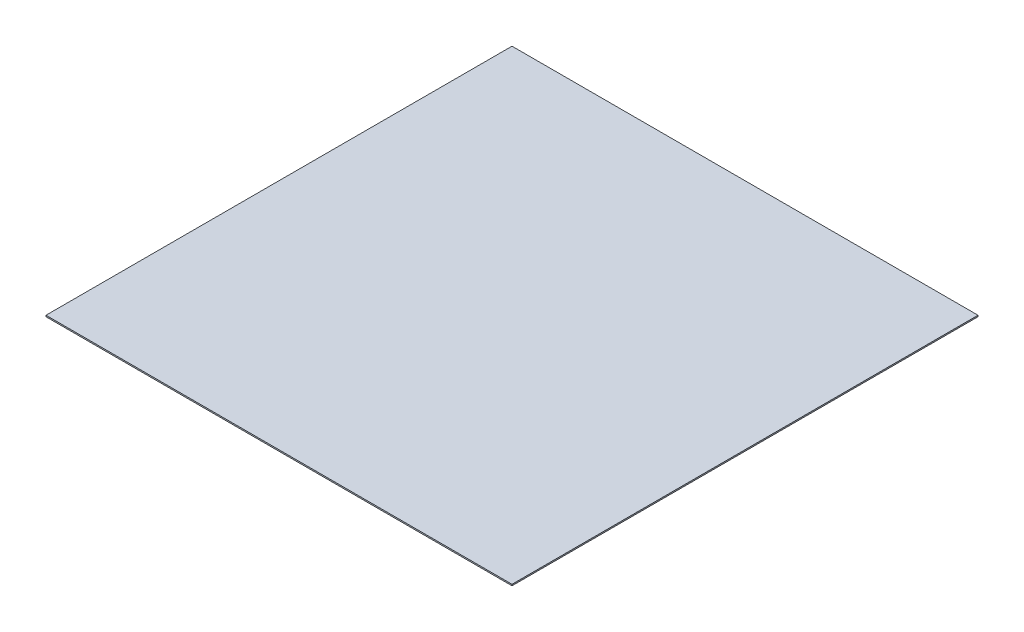
ISO-10303-21;
HEADER;
FILE_DESCRIPTION(('STEP AP214'),'2;1');
FILE_NAME('part.step','',(''),(''),'','','');
FILE_SCHEMA(('AUTOMOTIVE_DESIGN { 1 0 10303 214 1 1 1 1 }'));
ENDSEC;
DATA;
#1=APPLICATION_CONTEXT('core data for automotive mechanical design processes');
#2=APPLICATION_PROTOCOL_DEFINITION('international standard','automotive_design',2000,#1);
#3=PRODUCT_CONTEXT('',#1,'mechanical');
#4=PRODUCT('Part','Part','',(#3));
#5=PRODUCT_RELATED_PRODUCT_CATEGORY('part','',(#4));
#6=PRODUCT_DEFINITION_FORMATION('','',#4);
#7=PRODUCT_DEFINITION_CONTEXT('part definition',#1,'design');
#8=PRODUCT_DEFINITION('design','',#6,#7);
#9=PRODUCT_DEFINITION_SHAPE('','',#8);
#10=(LENGTH_UNIT() NAMED_UNIT(*) SI_UNIT(.MILLI.,.METRE.));
#11=(NAMED_UNIT(*) PLANE_ANGLE_UNIT() SI_UNIT($,.RADIAN.));
#12=(NAMED_UNIT(*) SI_UNIT($,.STERADIAN.) SOLID_ANGLE_UNIT());
#13=UNCERTAINTY_MEASURE_WITH_UNIT(LENGTH_MEASURE(1.E-05),#10,'distance_accuracy_value','');
#14=(GEOMETRIC_REPRESENTATION_CONTEXT(3) GLOBAL_UNCERTAINTY_ASSIGNED_CONTEXT((#13)) GLOBAL_UNIT_ASSIGNED_CONTEXT((#10,
#11,#12)) REPRESENTATION_CONTEXT('',''));
#15=CARTESIAN_POINT('',(0.,0.,0.));
#16=DIRECTION('',(0.,0.,1.));
#17=DIRECTION('',(1.,0.,0.));
#18=AXIS2_PLACEMENT_3D('',#15,#16,#17);
#19=CARTESIAN_POINT('',(0.,1.,0.));
#20=DIRECTION('',(1.,0.,0.));
#21=DIRECTION('',(0.,0.,-1.));
#22=AXIS2_PLACEMENT_3D('',#19,#20,#21);
#23=PLANE('',#22);
#24=DIRECTION('',(0.,0.,1.));
#25=VECTOR('',#24,1.);
#26=CARTESIAN_POINT('',(0.,0.,0.));
#27=LINE('',#26,#25);
#28=CARTESIAN_POINT('',(0.,0.,0.));
#29=VERTEX_POINT('',#28);
#30=CARTESIAN_POINT('',(0.,0.,345.));
#31=VERTEX_POINT('',#30);
#32=EDGE_CURVE('E97',#29,#31,#27,.T.);
#33=ORIENTED_EDGE('',*,*,#32,.T.);
#34=DIRECTION('',(0.,-1.,0.));
#35=VECTOR('',#34,1.);
#36=CARTESIAN_POINT('',(0.,1.,345.));
#37=LINE('',#36,#35);
#38=CARTESIAN_POINT('',(0.,1.,345.));
#39=VERTEX_POINT('',#38);
#40=EDGE_CURVE('E11',#39,#31,#37,.T.);
#41=ORIENTED_EDGE('',*,*,#40,.F.);
#42=DIRECTION('',(0.,0.,1.));
#43=VECTOR('',#42,1.);
#44=CARTESIAN_POINT('',(0.,1.,0.));
#45=LINE('',#44,#43);
#46=CARTESIAN_POINT('',(0.,1.,0.));
#47=VERTEX_POINT('',#46);
#48=EDGE_CURVE('E85',#47,#39,#45,.T.);
#49=ORIENTED_EDGE('',*,*,#48,.F.);
#50=DIRECTION('',(0.,-1.,0.));
#51=VECTOR('',#50,1.);
#52=CARTESIAN_POINT('',(0.,1.,0.));
#53=LINE('',#52,#51);
#54=EDGE_CURVE('E93',#47,#29,#53,.T.);
#55=ORIENTED_EDGE('',*,*,#54,.T.);
#56=EDGE_LOOP('',(#33,#41,#49,#55));
#57=FACE_BOUND('',#56,.T.);
#58=ADVANCED_FACE('F34',(#57),#23,.F.);
#59=CARTESIAN_POINT('',(0.,1.,345.));
#60=DIRECTION('',(0.,0.,-1.));
#61=DIRECTION('',(-1.,0.,0.));
#62=AXIS2_PLACEMENT_3D('',#59,#60,#61);
#63=PLANE('',#62);
#64=DIRECTION('',(1.,0.,0.));
#65=VECTOR('',#64,1.);
#66=CARTESIAN_POINT('',(0.,0.,345.));
#67=LINE('',#66,#65);
#68=CARTESIAN_POINT('',(345.,0.,345.));
#69=VERTEX_POINT('',#68);
#70=EDGE_CURVE('E89',#31,#69,#67,.T.);
#71=ORIENTED_EDGE('',*,*,#70,.T.);
#72=DIRECTION('',(0.,-1.,0.));
#73=VECTOR('',#72,1.);
#74=CARTESIAN_POINT('',(345.,1.,345.));
#75=LINE('',#74,#73);
#76=CARTESIAN_POINT('',(345.,1.,345.));
#77=VERTEX_POINT('',#76);
#78=EDGE_CURVE('E42',#77,#69,#75,.T.);
#79=ORIENTED_EDGE('',*,*,#78,.F.);
#80=DIRECTION('',(1.,0.,0.));
#81=VECTOR('',#80,1.);
#82=CARTESIAN_POINT('',(0.,1.,345.));
#83=LINE('',#82,#81);
#84=EDGE_CURVE('E80',#39,#77,#83,.T.);
#85=ORIENTED_EDGE('',*,*,#84,.F.);
#86=ORIENTED_EDGE('',*,*,#40,.T.);
#87=EDGE_LOOP('',(#71,#79,#85,#86));
#88=FACE_BOUND('',#87,.T.);
#89=ADVANCED_FACE('F88',(#88),#63,.F.);
#90=CARTESIAN_POINT('',(345.,1.,0.));
#91=DIRECTION('',(-1.,0.,0.));
#92=DIRECTION('',(0.,0.,1.));
#93=AXIS2_PLACEMENT_3D('',#90,#91,#92);
#94=PLANE('',#93);
#95=DIRECTION('',(0.,0.,-1.));
#96=VECTOR('',#95,1.);
#97=CARTESIAN_POINT('',(345.,0.,0.));
#98=LINE('',#97,#96);
#99=CARTESIAN_POINT('',(345.,0.,0.));
#100=VERTEX_POINT('',#99);
#101=EDGE_CURVE('E67',#69,#100,#98,.T.);
#102=ORIENTED_EDGE('',*,*,#101,.T.);
#103=DIRECTION('',(0.,-1.,0.));
#104=VECTOR('',#103,1.);
#105=CARTESIAN_POINT('',(345.,1.,0.));
#106=LINE('',#105,#104);
#107=CARTESIAN_POINT('',(345.,1.,0.));
#108=VERTEX_POINT('',#107);
#109=EDGE_CURVE('E90',#108,#100,#106,.T.);
#110=ORIENTED_EDGE('',*,*,#109,.F.);
#111=DIRECTION('',(0.,0.,-1.));
#112=VECTOR('',#111,1.);
#113=CARTESIAN_POINT('',(345.,1.,0.));
#114=LINE('',#113,#112);
#115=EDGE_CURVE('E83',#77,#108,#114,.T.);
#116=ORIENTED_EDGE('',*,*,#115,.F.);
#117=ORIENTED_EDGE('',*,*,#78,.T.);
#118=EDGE_LOOP('',(#102,#110,#116,#117));
#119=FACE_BOUND('',#118,.T.);
#120=ADVANCED_FACE('F91',(#119),#94,.F.);
#121=CARTESIAN_POINT('',(0.,1.,0.));
#122=DIRECTION('',(0.,0.,1.));
#123=DIRECTION('',(1.,0.,0.));
#124=AXIS2_PLACEMENT_3D('',#121,#122,#123);
#125=PLANE('',#124);
#126=DIRECTION('',(-1.,0.,0.));
#127=VECTOR('',#126,1.);
#128=CARTESIAN_POINT('',(0.,0.,0.));
#129=LINE('',#128,#127);
#130=EDGE_CURVE('E73',#100,#29,#129,.T.);
#131=ORIENTED_EDGE('',*,*,#130,.T.);
#132=ORIENTED_EDGE('',*,*,#54,.F.);
#133=DIRECTION('',(-1.,0.,0.));
#134=VECTOR('',#133,1.);
#135=CARTESIAN_POINT('',(0.,1.,0.));
#136=LINE('',#135,#134);
#137=EDGE_CURVE('E50',#108,#47,#136,.T.);
#138=ORIENTED_EDGE('',*,*,#137,.F.);
#139=ORIENTED_EDGE('',*,*,#109,.T.);
#140=EDGE_LOOP('',(#131,#132,#138,#139));
#141=FACE_BOUND('',#140,.T.);
#142=ADVANCED_FACE('F104',(#141),#125,.F.);
#143=CARTESIAN_POINT('',(0.,1.,0.));
#144=DIRECTION('',(0.,1.,0.));
#145=DIRECTION('',(0.,0.,1.));
#146=AXIS2_PLACEMENT_3D('',#143,#144,#145);
#147=PLANE('',#146);
#148=ORIENTED_EDGE('',*,*,#48,.T.);
#149=ORIENTED_EDGE('',*,*,#84,.T.);
#150=ORIENTED_EDGE('',*,*,#115,.T.);
#151=ORIENTED_EDGE('',*,*,#137,.T.);
#152=EDGE_LOOP('',(#148,#149,#150,#151));
#153=FACE_BOUND('',#152,.T.);
#154=ADVANCED_FACE('F81',(#153),#147,.T.);
#155=CARTESIAN_POINT('',(0.,0.,0.));
#156=DIRECTION('',(0.,1.,0.));
#157=DIRECTION('',(0.,0.,1.));
#158=AXIS2_PLACEMENT_3D('',#155,#156,#157);
#159=PLANE('',#158);
#160=ORIENTED_EDGE('',*,*,#32,.F.);
#161=ORIENTED_EDGE('',*,*,#130,.F.);
#162=ORIENTED_EDGE('',*,*,#101,.F.);
#163=ORIENTED_EDGE('',*,*,#70,.F.);
#164=EDGE_LOOP('',(#160,#161,#162,#163));
#165=FACE_BOUND('',#164,.T.);
#166=ADVANCED_FACE('F107',(#165),#159,.F.);
#167=CLOSED_SHELL('',(#58,#89,#120,#142,#154,#166));
#168=MANIFOLD_SOLID_BREP('B2',#167);
#169=ADVANCED_BREP_SHAPE_REPRESENTATION('',(#18,#168),#14);
#170=SHAPE_DEFINITION_REPRESENTATION(#9,#169);
ENDSEC;
END-ISO-10303-21;
